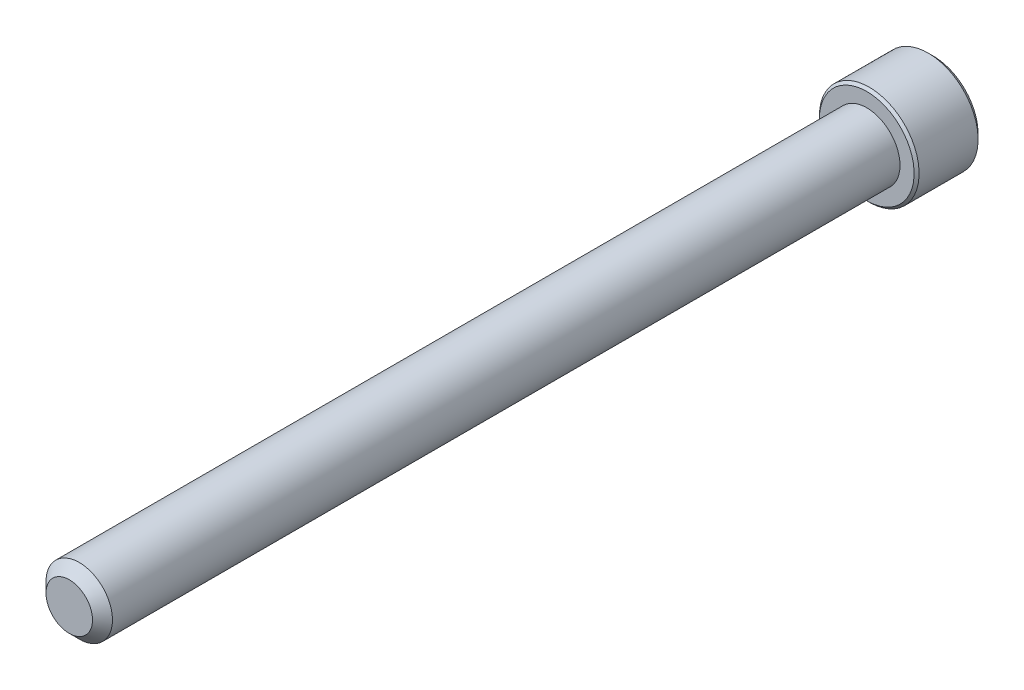
ISO-10303-21;
HEADER;
FILE_DESCRIPTION(('STEP AP214'),'2;1');
FILE_NAME('part.step','',(''),(''),'','','');
FILE_SCHEMA(('AUTOMOTIVE_DESIGN { 1 0 10303 214 1 1 1 1 }'));
ENDSEC;
DATA;
#1=APPLICATION_CONTEXT('core data for automotive mechanical design processes');
#2=APPLICATION_PROTOCOL_DEFINITION('international standard','automotive_design',2000,#1);
#3=PRODUCT_CONTEXT('',#1,'mechanical');
#4=PRODUCT('Part','Part','',(#3));
#5=PRODUCT_RELATED_PRODUCT_CATEGORY('part','',(#4));
#6=PRODUCT_DEFINITION_FORMATION('','',#4);
#7=PRODUCT_DEFINITION_CONTEXT('part definition',#1,'design');
#8=PRODUCT_DEFINITION('design','',#6,#7);
#9=PRODUCT_DEFINITION_SHAPE('','',#8);
#10=(LENGTH_UNIT() NAMED_UNIT(*) SI_UNIT(.MILLI.,.METRE.));
#11=(NAMED_UNIT(*) PLANE_ANGLE_UNIT() SI_UNIT($,.RADIAN.));
#12=(NAMED_UNIT(*) SI_UNIT($,.STERADIAN.) SOLID_ANGLE_UNIT());
#13=UNCERTAINTY_MEASURE_WITH_UNIT(LENGTH_MEASURE(1.E-05),#10,'distance_accuracy_value','');
#14=(GEOMETRIC_REPRESENTATION_CONTEXT(3) GLOBAL_UNCERTAINTY_ASSIGNED_CONTEXT((#13)) GLOBAL_UNIT_ASSIGNED_CONTEXT((#10,
#11,#12)) REPRESENTATION_CONTEXT('',''));
#15=CARTESIAN_POINT('',(0.,0.,0.));
#16=DIRECTION('',(0.,0.,1.));
#17=DIRECTION('',(1.,0.,0.));
#18=AXIS2_PLACEMENT_3D('',#15,#16,#17);
#19=CARTESIAN_POINT('',(0.,0.,-76.2));
#20=DIRECTION('',(0.,0.,1.));
#21=DIRECTION('',(1.,0.,0.));
#22=AXIS2_PLACEMENT_3D('',#19,#20,#21);
#23=CYLINDRICAL_SURFACE('',#22,3.175);
#24=CARTESIAN_POINT('',(0.,0.,-0.952499999999995));
#25=DIRECTION('',(0.,0.,1.));
#26=DIRECTION('',(1.,0.,0.));
#27=AXIS2_PLACEMENT_3D('',#24,#25,#26);
#28=CIRCLE('',#27,3.175);
#29=CARTESIAN_POINT('',(3.175,0.,-0.952499999999995));
#30=VERTEX_POINT('',#29);
#31=EDGE_CURVE('E109',#30,#30,#28,.F.);
#32=CARTESIAN_POINT('',(0.,0.,-76.2));
#33=DIRECTION('',(0.,0.,-1.));
#34=DIRECTION('',(-1.,0.,0.));
#35=AXIS2_PLACEMENT_3D('',#32,#33,#34);
#36=CIRCLE('',#35,3.175);
#37=CARTESIAN_POINT('',(3.175,0.,-76.2));
#38=VERTEX_POINT('',#37);
#39=EDGE_CURVE('E212',#38,#38,#36,.F.);
#40=CARTESIAN_POINT('',(3.175,0.,-0.952499999999995));
#41=CARTESIAN_POINT('',(3.175,0.,-1.736328125));
#42=CARTESIAN_POINT('',(3.175,0.,-2.52015625));
#43=CARTESIAN_POINT('',(3.175,0.,-4.0878125));
#44=CARTESIAN_POINT('',(3.175,0.,-4.87164062499999));
#45=CARTESIAN_POINT('',(3.175,0.,-6.43929687499999));
#46=CARTESIAN_POINT('',(3.175,0.,-7.22312499999999));
#47=CARTESIAN_POINT('',(3.175,0.,-8.79078124999999));
#48=CARTESIAN_POINT('',(3.175,0.,-9.574609375));
#49=CARTESIAN_POINT('',(3.175,0.,-11.142265625));
#50=CARTESIAN_POINT('',(3.175,0.,-11.92609375));
#51=CARTESIAN_POINT('',(3.175,0.,-13.49375));
#52=CARTESIAN_POINT('',(3.175,0.,-14.277578125));
#53=CARTESIAN_POINT('',(3.175,0.,-15.845234375));
#54=CARTESIAN_POINT('',(3.175,0.,-16.6290625));
#55=CARTESIAN_POINT('',(3.175,0.,-18.19671875));
#56=CARTESIAN_POINT('',(3.175,0.,-18.980546875));
#57=CARTESIAN_POINT('',(3.175,0.,-20.548203125));
#58=CARTESIAN_POINT('',(3.175,0.,-21.33203125));
#59=CARTESIAN_POINT('',(3.175,0.,-22.8996875));
#60=CARTESIAN_POINT('',(3.175,0.,-23.683515625));
#61=CARTESIAN_POINT('',(3.175,0.,-25.251171875));
#62=CARTESIAN_POINT('',(3.175,0.,-26.035));
#63=CARTESIAN_POINT('',(3.175,0.,-27.60265625));
#64=CARTESIAN_POINT('',(3.175,0.,-28.386484375));
#65=CARTESIAN_POINT('',(3.175,0.,-29.954140625));
#66=CARTESIAN_POINT('',(3.175,0.,-30.73796875));
#67=CARTESIAN_POINT('',(3.175,0.,-32.305625));
#68=CARTESIAN_POINT('',(3.175,0.,-33.089453125));
#69=CARTESIAN_POINT('',(3.175,0.,-34.657109375));
#70=CARTESIAN_POINT('',(3.175,0.,-35.4409375));
#71=CARTESIAN_POINT('',(3.175,0.,-37.00859375));
#72=CARTESIAN_POINT('',(3.175,0.,-37.792421875));
#73=CARTESIAN_POINT('',(3.175,0.,-39.360078125));
#74=CARTESIAN_POINT('',(3.175,0.,-40.14390625));
#75=CARTESIAN_POINT('',(3.175,0.,-41.7115625));
#76=CARTESIAN_POINT('',(3.175,0.,-42.495390625));
#77=CARTESIAN_POINT('',(3.175,0.,-44.063046875));
#78=CARTESIAN_POINT('',(3.175,0.,-44.846875));
#79=CARTESIAN_POINT('',(3.175,0.,-46.41453125));
#80=CARTESIAN_POINT('',(3.175,0.,-47.198359375));
#81=CARTESIAN_POINT('',(3.175,0.,-48.766015625));
#82=CARTESIAN_POINT('',(3.175,0.,-49.54984375));
#83=CARTESIAN_POINT('',(3.175,0.,-51.1175));
#84=CARTESIAN_POINT('',(3.175,0.,-51.901328125));
#85=CARTESIAN_POINT('',(3.175,0.,-53.468984375));
#86=CARTESIAN_POINT('',(3.175,0.,-54.2528125));
#87=CARTESIAN_POINT('',(3.175,0.,-55.82046875));
#88=CARTESIAN_POINT('',(3.175,0.,-56.604296875));
#89=CARTESIAN_POINT('',(3.175,0.,-58.171953125));
#90=CARTESIAN_POINT('',(3.175,0.,-58.95578125));
#91=CARTESIAN_POINT('',(3.175,0.,-60.5234375));
#92=CARTESIAN_POINT('',(3.175,0.,-61.307265625));
#93=CARTESIAN_POINT('',(3.175,0.,-62.874921875));
#94=CARTESIAN_POINT('',(3.175,0.,-63.65875));
#95=CARTESIAN_POINT('',(3.175,0.,-65.22640625));
#96=CARTESIAN_POINT('',(3.175,0.,-66.010234375));
#97=CARTESIAN_POINT('',(3.175,0.,-67.577890625));
#98=CARTESIAN_POINT('',(3.175,0.,-68.36171875));
#99=CARTESIAN_POINT('',(3.175,0.,-69.929375));
#100=CARTESIAN_POINT('',(3.175,0.,-70.713203125));
#101=CARTESIAN_POINT('',(3.175,0.,-72.280859375));
#102=CARTESIAN_POINT('',(3.175,0.,-73.0646875));
#103=CARTESIAN_POINT('',(3.175,0.,-74.63234375));
#104=CARTESIAN_POINT('',(3.175,0.,-75.416171875));
#105=CARTESIAN_POINT('',(3.175,0.,-76.2));
#106=B_SPLINE_CURVE_WITH_KNOTS('',3,(#40,#41,#42,#43,#44,#45,#46,#47,#48,#49,#50,#51,#52,#53,
#54,#55,#56,#57,#58,#59,#60,#61,#62,#63,#64,#65,#66,#67,#68,#69,#70,#71,#72,#73,#74,#75,#76,#77,
#78,#79,#80,#81,#82,#83,#84,#85,#86,#87,#88,#89,#90,#91,#92,#93,#94,#95,#96,#97,#98,#99,#100,
#101,#102,#103,#104,#105),.UNSPECIFIED.,.F.,.F.,(4,2,2,2,2,2,2,2,2,2,2,2,2,2,2,2,2,2,2,2,2,2,2,
2,2,2,2,2,2,2,2,2,4),(0.,2.351484375,4.70296874999999,7.054453125,9.4059375,11.757421875,
14.10890625,16.460390625,18.811875,21.163359375,23.51484375,25.866328125,28.2178125,
30.569296875,32.92078125,35.272265625,37.62375,39.975234375,42.32671875,44.678203125,47.0296875,
49.381171875,51.73265625,54.084140625,56.435625,58.787109375,61.13859375,63.490078125,
65.8415625,68.193046875,70.54453125,72.896015625,75.2475),.UNSPECIFIED.);
#107=EDGE_CURVE('BSEAM35',#30,#38,#106,.T.);
#108=ORIENTED_EDGE('',*,*,#31,.T.);
#109=ORIENTED_EDGE('',*,*,#39,.T.);
#110=ORIENTED_EDGE('',*,*,#107,.T.);
#111=ORIENTED_EDGE('',*,*,#107,.F.);
#112=EDGE_LOOP('',(#108,#110,#109,#111));
#113=FACE_BOUND('',#112,.T.);
#114=ADVANCED_FACE('F35',(#113),#23,.T.);
#115=CARTESIAN_POINT('',(0.,0.,0.));
#116=DIRECTION('',(0.,0.,1.));
#117=DIRECTION('',(1.,0.,0.));
#118=AXIS2_PLACEMENT_3D('',#115,#116,#117);
#119=PLANE('',#118);
#120=CARTESIAN_POINT('',(0.,0.,0.));
#121=DIRECTION('',(0.,0.,1.));
#122=DIRECTION('',(1.,0.,0.));
#123=AXIS2_PLACEMENT_3D('',#120,#121,#122);
#124=CIRCLE('',#123,2.2225);
#125=CARTESIAN_POINT('',(2.2225,0.,0.));
#126=VERTEX_POINT('',#125);
#127=EDGE_CURVE('E211',#126,#126,#124,.T.);
#128=ORIENTED_EDGE('',*,*,#127,.T.);
#129=EDGE_LOOP('',(#128));
#130=FACE_BOUND('',#129,.T.);
#131=ADVANCED_FACE('F189',(#130),#119,.T.);
#132=CARTESIAN_POINT('',(0.,0.,0.));
#133=DIRECTION('',(0.,0.,-1.));
#134=DIRECTION('',(-1.,0.,0.));
#135=AXIS2_PLACEMENT_3D('',#132,#133,#134);
#136=CONICAL_SURFACE('',#135,2.2225,0.785398163397457);
#137=ORIENTED_EDGE('',*,*,#31,.F.);
#138=EDGE_LOOP('',(#137));
#139=FACE_BOUND('',#138,.T.);
#140=ORIENTED_EDGE('',*,*,#127,.F.);
#141=EDGE_LOOP('',(#140));
#142=FACE_BOUND('',#141,.T.);
#143=ADVANCED_FACE('F195',(#139,#142),#136,.T.);
#144=CARTESIAN_POINT('',(0.,0.,-82.55));
#145=DIRECTION('',(0.,0.,1.));
#146=DIRECTION('',(1.,0.,0.));
#147=AXIS2_PLACEMENT_3D('',#144,#145,#146);
#148=CYLINDRICAL_SURFACE('',#147,4.7625);
#149=CARTESIAN_POINT('',(0.,0.,-76.438125));
#150=DIRECTION('',(0.,0.,-1.));
#151=DIRECTION('',(-1.,0.,0.));
#152=AXIS2_PLACEMENT_3D('',#149,#150,#151);
#153=CIRCLE('',#152,4.7625);
#154=CARTESIAN_POINT('',(-4.76249999999999,0.,-76.438125));
#155=VERTEX_POINT('',#154);
#156=EDGE_CURVE('E43',#155,#155,#153,.T.);
#157=ORIENTED_EDGE('',*,*,#156,.T.);
#158=EDGE_LOOP('',(#157));
#159=FACE_BOUND('',#158,.T.);
#160=CARTESIAN_POINT('',(0.,0.,-82.07375));
#161=DIRECTION('',(0.,0.,-1.));
#162=DIRECTION('',(-1.,0.,0.));
#163=AXIS2_PLACEMENT_3D('',#160,#161,#162);
#164=CIRCLE('',#163,4.7625);
#165=CARTESIAN_POINT('',(-4.7625,0.,-82.07375));
#166=VERTEX_POINT('',#165);
#167=EDGE_CURVE('E172',#166,#166,#164,.F.);
#168=ORIENTED_EDGE('',*,*,#167,.T.);
#169=EDGE_LOOP('',(#168));
#170=FACE_BOUND('',#169,.T.);
#171=ADVANCED_FACE('F177',(#159,#170),#148,.T.);
#172=CARTESIAN_POINT('',(0.,0.,-82.55));
#173=DIRECTION('',(0.,0.,-1.));
#174=DIRECTION('',(-1.,0.,0.));
#175=AXIS2_PLACEMENT_3D('',#172,#173,#174);
#176=PLANE('',#175);
#177=CARTESIAN_POINT('',(0.,0.,-82.55));
#178=DIRECTION('',(0.,0.,-1.));
#179=DIRECTION('',(-1.,0.,0.));
#180=AXIS2_PLACEMENT_3D('',#177,#178,#179);
#181=CIRCLE('',#180,4.28625000000001);
#182=CARTESIAN_POINT('',(-4.28625000000001,0.,-82.55));
#183=VERTEX_POINT('',#182);
#184=EDGE_CURVE('E108',#183,#183,#181,.T.);
#185=ORIENTED_EDGE('',*,*,#184,.T.);
#186=EDGE_LOOP('',(#185));
#187=FACE_BOUND('',#186,.T.);
#188=CARTESIAN_POINT('',(0.,0.,-82.55));
#189=DIRECTION('',(0.,0.,-1.));
#190=DIRECTION('',(-1.,0.,0.));
#191=AXIS2_PLACEMENT_3D('',#188,#189,#190);
#192=CIRCLE('',#191,2.74963065701559);
#193=CARTESIAN_POINT('',(-2.38125,1.3748153285078,-82.55));
#194=VERTEX_POINT('',#193);
#195=CARTESIAN_POINT('',(0.,2.74963065701559,-82.55));
#196=VERTEX_POINT('',#195);
#197=EDGE_CURVE('E89',#194,#196,#192,.T.);
#198=ORIENTED_EDGE('',*,*,#197,.F.);
#199=CARTESIAN_POINT('',(-2.38125,-1.3748153285078,-82.55));
#200=VERTEX_POINT('',#199);
#201=EDGE_CURVE('E49',#200,#194,#192,.T.);
#202=ORIENTED_EDGE('',*,*,#201,.F.);
#203=CARTESIAN_POINT('',(0.,-2.74963065701559,-82.55));
#204=VERTEX_POINT('',#203);
#205=EDGE_CURVE('E271',#204,#200,#192,.T.);
#206=ORIENTED_EDGE('',*,*,#205,.F.);
#207=CARTESIAN_POINT('',(2.38125,-1.37481532850779,-82.55));
#208=VERTEX_POINT('',#207);
#209=EDGE_CURVE('E56',#208,#204,#192,.T.);
#210=ORIENTED_EDGE('',*,*,#209,.F.);
#211=CARTESIAN_POINT('',(2.38125,1.3748153285078,-82.55));
#212=VERTEX_POINT('',#211);
#213=EDGE_CURVE('E130',#212,#208,#192,.T.);
#214=ORIENTED_EDGE('',*,*,#213,.F.);
#215=EDGE_CURVE('E98',#196,#212,#192,.T.);
#216=ORIENTED_EDGE('',*,*,#215,.F.);
#217=EDGE_LOOP('',(#198,#202,#206,#210,#214,#216));
#218=FACE_BOUND('',#217,.T.);
#219=ADVANCED_FACE('F129',(#187,#218),#176,.T.);
#220=CARTESIAN_POINT('',(0.,0.,-76.2));
#221=DIRECTION('',(0.,0.,-1.));
#222=DIRECTION('',(-1.,0.,0.));
#223=AXIS2_PLACEMENT_3D('',#220,#221,#222);
#224=PLANE('',#223);
#225=CARTESIAN_POINT('',(0.,0.,-76.2));
#226=DIRECTION('',(0.,0.,-1.));
#227=DIRECTION('',(-1.,0.,0.));
#228=AXIS2_PLACEMENT_3D('',#225,#226,#227);
#229=CIRCLE('',#228,4.524375);
#230=CARTESIAN_POINT('',(-4.52437499999999,0.,-76.2));
#231=VERTEX_POINT('',#230);
#232=EDGE_CURVE('E11',#231,#231,#229,.F.);
#233=ORIENTED_EDGE('',*,*,#232,.T.);
#234=EDGE_LOOP('',(#233));
#235=FACE_BOUND('',#234,.T.);
#236=ORIENTED_EDGE('',*,*,#39,.F.);
#237=EDGE_LOOP('',(#236));
#238=FACE_BOUND('',#237,.T.);
#239=ADVANCED_FACE('F283',(#235,#238),#224,.F.);
#240=CARTESIAN_POINT('',(0.,0.,-82.55));
#241=DIRECTION('',(0.,0.,-1.));
#242=DIRECTION('',(-1.,0.,0.));
#243=AXIS2_PLACEMENT_3D('',#240,#241,#242);
#244=CONICAL_SURFACE('',#243,2.74963065701559,0.78539816339745);
#245=ORIENTED_EDGE('',*,*,#215,.T.);
#246=CARTESIAN_POINT('',(-0.000200000000002362,2.74974612706943,-82.5501154773272));
#247=CARTESIAN_POINT('',(0.0816567823790494,2.70248609172789,-82.5028948967095));
#248=CARTESIAN_POINT('',(0.16488233377176,2.65443579722785,-82.4584475752929));
#249=CARTESIAN_POINT('',(0.33458848083804,2.556455907536,-82.3770654569856));
#250=CARTESIAN_POINT('',(0.421085217353102,2.50651699342501,-82.3401759430951));
#251=CARTESIAN_POINT('',(0.595501774009042,2.40581754748857,-82.2769834131659));
#252=CARTESIAN_POINT('',(0.683377171180675,2.35508266327638,-82.2505215587295));
#253=CARTESIAN_POINT('',(0.861062594070876,2.25249593653965,-82.209751515616));
#254=CARTESIAN_POINT('',(0.950867191185869,2.20064722822085,-82.1954128915305));
#255=CARTESIAN_POINT('',(1.10563960313034,2.11128933452158,-82.1824757847701));
#256=CARTESIAN_POINT('',(1.17040744896962,2.07389560129144,-82.1805606046532));
#257=CARTESIAN_POINT('',(1.29983727933557,1.99916925388849,-82.1837866227677));
#258=CARTESIAN_POINT('',(1.36449921879335,1.96183666573622,-82.1889302948571));
#259=CARTESIAN_POINT('',(1.49321254857739,1.88752399013711,-82.2059813108716));
#260=CARTESIAN_POINT('',(1.55726317423485,1.85054434417201,-82.2178962213493));
#261=CARTESIAN_POINT('',(1.68425683890527,1.77722451768917,-82.247835672352));
#262=CARTESIAN_POINT('',(1.74719996243582,1.74088428837517,-82.2658597445184));
#263=CARTESIAN_POINT('',(1.90842615073218,1.64780030516185,-82.3193688075524));
#264=CARTESIAN_POINT('',(2.00570949128784,1.59163374230437,-82.3588874208722));
#265=CARTESIAN_POINT('',(2.14875606262557,1.50904576583588,-82.4256003435508));
#266=CARTESIAN_POINT('',(2.19589628894397,1.48182934348129,-82.4490402091113));
#267=CARTESIAN_POINT('',(2.28930352636664,1.42790064981105,-82.4980566766595));
#268=CARTESIAN_POINT('',(2.33557105249682,1.40118808114505,-82.5236319667669));
#269=CARTESIAN_POINT('',(2.38145,1.37469985845396,-82.5501154773272));
#270=B_SPLINE_CURVE_WITH_KNOTS('',3,(#246,#247,#248,#249,#250,#251,#252,#253,#254,#255,#256,
#257,#258,#259,#260,#261,#262,#263,#264,#265,#266,#267,#268,#269),.UNSPECIFIED.,.F.,.F.,(4,2,2,
2,2,2,2,2,2,2,2,4),(0.,0.317196610611951,0.636241461041222,0.950218950629228,1.26340583824126,
1.48752413747844,1.71172100167747,1.93616888974082,2.16059957440836,2.51709639744764,
2.694861473691,2.87251813383155),.UNSPECIFIED.);
#271=EDGE_CURVE('E103',#196,#212,#270,.T.);
#272=ORIENTED_EDGE('',*,*,#271,.F.);
#273=EDGE_LOOP('',(#245,#272));
#274=FACE_BOUND('',#273,.T.);
#275=ADVANCED_FACE('F104',(#274),#244,.F.);
#276=ORIENTED_EDGE('',*,*,#213,.T.);
#277=CARTESIAN_POINT('',(2.38125,-2.74194290589387,-83.4319808945799));
#278=CARTESIAN_POINT('',(2.38125,-2.6751796105604,-83.3815846679781));
#279=CARTESIAN_POINT('',(2.38125,-2.60804251112753,-83.3316755875907));
#280=CARTESIAN_POINT('',(2.38125,-2.47287325055307,-83.2330498309857));
#281=CARTESIAN_POINT('',(2.38125,-2.40484086895313,-83.1843334572448));
#282=CARTESIAN_POINT('',(2.38125,-2.26723593505442,-83.0879648544535));
#283=CARTESIAN_POINT('',(2.38125,-2.1976555334605,-83.0403237954326));
#284=CARTESIAN_POINT('',(2.38125,-2.05731367842204,-82.9468199233866));
#285=CARTESIAN_POINT('',(2.38125,-1.98655230892574,-82.9009569847287));
#286=CARTESIAN_POINT('',(2.38125,-1.83957751909227,-82.8088459007133));
#287=CARTESIAN_POINT('',(2.38125,-1.76328361992077,-82.7627255173929));
#288=CARTESIAN_POINT('',(2.38125,-1.60891357704461,-82.6735183038905));
#289=CARTESIAN_POINT('',(2.38125,-1.53083712149138,-82.6304320099754));
#290=CARTESIAN_POINT('',(2.38125,-1.37291620334515,-82.5482265014712));
#291=CARTESIAN_POINT('',(2.38125,-1.29307799938229,-82.5090953578519));
#292=CARTESIAN_POINT('',(2.38125,-1.13121425093133,-82.4356679503152));
#293=CARTESIAN_POINT('',(2.38125,-1.04918943681796,-82.4013700954538));
#294=CARTESIAN_POINT('',(2.38125,-0.889535256759279,-82.3413546314156));
#295=CARTESIAN_POINT('',(2.38125,-0.812083865770267,-82.315168478432));
#296=CARTESIAN_POINT('',(2.38125,-0.655316366527669,-82.2690097514868));
#297=CARTESIAN_POINT('',(2.38125,-0.576000130216834,-82.2490376055838));
#298=CARTESIAN_POINT('',(2.38125,-0.417295761573375,-82.2166821452488));
#299=CARTESIAN_POINT('',(2.38125,-0.337934576883846,-82.2041688083548));
#300=CARTESIAN_POINT('',(2.38125,-0.178363852969581,-82.1869738601659));
#301=CARTESIAN_POINT('',(2.38125,-0.0981544619617629,-82.1822909026126));
#302=CARTESIAN_POINT('',(2.38125,0.0594188034321334,-82.1811044408392));
#303=CARTESIAN_POINT('',(2.38125,0.136780588525996,-82.1843110105046));
#304=CARTESIAN_POINT('',(2.38125,0.290840960607339,-82.1980870567428));
#305=CARTESIAN_POINT('',(2.38125,0.367539482435409,-82.2086572485871));
#306=CARTESIAN_POINT('',(2.38125,0.521017492835387,-82.2367628298525));
#307=CARTESIAN_POINT('',(2.38125,0.597774958394048,-82.2544167489315));
#308=CARTESIAN_POINT('',(2.38125,0.74960981425701,-82.2957513962434));
#309=CARTESIAN_POINT('',(2.38125,0.824687344568027,-82.3194316201904));
#310=CARTESIAN_POINT('',(2.38125,1.06107814410025,-82.402894862956));
#311=CARTESIAN_POINT('',(2.38125,1.2190478622181,-82.4721839270396));
#312=CARTESIAN_POINT('',(2.38125,1.45021000267341,-82.5876640838597));
#313=CARTESIAN_POINT('',(2.38125,1.52644290442584,-82.6281730572583));
#314=CARTESIAN_POINT('',(2.38125,1.67717618538172,-82.7123026892371));
#315=CARTESIAN_POINT('',(2.38125,1.7516768735884,-82.7559227870999));
#316=CARTESIAN_POINT('',(2.38125,1.89548152088328,-82.843412556489));
#317=CARTESIAN_POINT('',(2.38125,1.96485959608998,-82.8871617927418));
#318=CARTESIAN_POINT('',(2.38125,2.10242624411169,-82.9765011587306));
#319=CARTESIAN_POINT('',(2.38125,2.17061472626633,-83.0220914279041));
#320=CARTESIAN_POINT('',(2.38125,2.30540317317354,-83.1144060050932));
#321=CARTESIAN_POINT('',(2.38125,2.37201154222166,-83.1611180928962));
#322=CARTESIAN_POINT('',(2.38125,2.50431800054459,-83.2557775780183));
#323=CARTESIAN_POINT('',(2.38125,2.57001633510792,-83.3037246320963));
#324=CARTESIAN_POINT('',(2.38125,2.63533378855947,-83.3521767335425));
#325=B_SPLINE_CURVE_WITH_KNOTS('',3,(#277,#278,#279,#280,#281,#282,#283,#284,#285,#286,#287,
#288,#289,#290,#291,#292,#293,#294,#295,#296,#297,#298,#299,#300,#301,#302,#303,#304,#305,#306,
#307,#308,#309,#310,#311,#312,#313,#314,#315,#316,#317,#318,#319,#320,#321,#322,#323,#324),
.UNSPECIFIED.,.F.,.F.,(4,2,2,2,2,2,2,2,2,2,2,2,2,2,2,2,2,2,2,2,2,2,2,4),(0.,0.250951284009993,
0.501965564827874,0.754924775973584,1.00786608164542,1.27526207798891,1.54270521780082,
1.80931602029338,2.07583885812519,2.32089852590463,2.56597507114536,2.80664400307699,
3.04727155311266,3.27918940971451,3.51112979698762,3.74712477407483,3.98310000940112,
4.49898139184705,4.75794323931355,5.01685853149448,5.26288960015361,5.50893933794673,
5.75299038397142,5.9969743162797),.UNSPECIFIED.);
#326=EDGE_CURVE('E97',#212,#208,#325,.F.);
#327=ORIENTED_EDGE('',*,*,#326,.F.);
#328=EDGE_LOOP('',(#276,#327));
#329=FACE_BOUND('',#328,.T.);
#330=ADVANCED_FACE('F277',(#329),#244,.F.);
#331=ORIENTED_EDGE('',*,*,#209,.T.);
#332=CARTESIAN_POINT('',(2.38145,-1.37469985845396,-82.5501154773272));
#333=CARTESIAN_POINT('',(2.29959321762095,-1.4219598937955,-82.5028948967095));
#334=CARTESIAN_POINT('',(2.21636766622824,-1.47001018829554,-82.4584475752929));
#335=CARTESIAN_POINT('',(2.04666151916196,-1.56799007798739,-82.3770654569856));
#336=CARTESIAN_POINT('',(1.9601647826469,-1.61792899209838,-82.3401759430951));
#337=CARTESIAN_POINT('',(1.78574822599096,-1.71862843803482,-82.2769834131659));
#338=CARTESIAN_POINT('',(1.69787282881932,-1.769363322247,-82.2505215587295));
#339=CARTESIAN_POINT('',(1.52018740592912,-1.87195004898373,-82.209751515616));
#340=CARTESIAN_POINT('',(1.43038280881413,-1.92379875730254,-82.1954128915305));
#341=CARTESIAN_POINT('',(1.27561039686966,-2.01315665100181,-82.1824757847701));
#342=CARTESIAN_POINT('',(1.21084255103038,-2.05055038423195,-82.1805606046532));
#343=CARTESIAN_POINT('',(1.08141272066443,-2.1252767316349,-82.1837866227677));
#344=CARTESIAN_POINT('',(1.01675078120665,-2.16260931978717,-82.1889302948571));
#345=CARTESIAN_POINT('',(0.888037451422605,-2.23692199538628,-82.2059813108716));
#346=CARTESIAN_POINT('',(0.823986825765148,-2.27390164135138,-82.2178962213493));
#347=CARTESIAN_POINT('',(0.696993161094728,-2.34722146783422,-82.247835672352));
#348=CARTESIAN_POINT('',(0.634050037564178,-2.38356169714822,-82.2658597445184));
#349=CARTESIAN_POINT('',(0.472823849267818,-2.47664568036154,-82.3193688075524));
#350=CARTESIAN_POINT('',(0.375540508712157,-2.53281224321902,-82.3588874208722));
#351=CARTESIAN_POINT('',(0.232493937374426,-2.61540021968751,-82.4256003435508));
#352=CARTESIAN_POINT('',(0.185353711056032,-2.6426166420421,-82.4490402091113));
#353=CARTESIAN_POINT('',(0.0919464736333587,-2.69654533571234,-82.4980566766595));
#354=CARTESIAN_POINT('',(0.0456789475031753,-2.72325790437834,-82.5236319667669));
#355=CARTESIAN_POINT('',(-0.000200000000005381,-2.74974612706943,-82.5501154773272));
#356=B_SPLINE_CURVE_WITH_KNOTS('',3,(#332,#333,#334,#335,#336,#337,#338,#339,#340,#341,#342,
#343,#344,#345,#346,#347,#348,#349,#350,#351,#352,#353,#354,#355),.UNSPECIFIED.,.F.,.F.,(4,2,2,
2,2,2,2,2,2,2,2,4),(0.,0.317196610611952,0.636241461041222,0.950218950629225,1.26340583824126,
1.48752413747844,1.71172100167747,1.93616888974082,2.16059957440836,2.51709639744764,
2.694861473691,2.87251813383155),.UNSPECIFIED.);
#357=EDGE_CURVE('E140',#208,#204,#356,.T.);
#358=ORIENTED_EDGE('',*,*,#357,.F.);
#359=EDGE_LOOP('',(#331,#358));
#360=FACE_BOUND('',#359,.T.);
#361=ADVANCED_FACE('F274',(#360),#244,.F.);
#362=ORIENTED_EDGE('',*,*,#205,.T.);
#363=CARTESIAN_POINT('',(0.000200000000001792,-2.74974612706943,-82.5501154773272));
#364=CARTESIAN_POINT('',(-0.0816567823790504,-2.70248609172789,-82.5028948967095));
#365=CARTESIAN_POINT('',(-0.164882333771761,-2.65443579722785,-82.4584475752929));
#366=CARTESIAN_POINT('',(-0.334588480838041,-2.556455907536,-82.3770654569856));
#367=CARTESIAN_POINT('',(-0.421085217353103,-2.50651699342501,-82.3401759430951));
#368=CARTESIAN_POINT('',(-0.595501774009043,-2.40581754748857,-82.2769834131659));
#369=CARTESIAN_POINT('',(-0.683377171180675,-2.35508266327638,-82.2505215587295));
#370=CARTESIAN_POINT('',(-0.861062594070875,-2.25249593653965,-82.209751515616));
#371=CARTESIAN_POINT('',(-0.95086719118587,-2.20064722822085,-82.1954128915305));
#372=CARTESIAN_POINT('',(-1.10563960313034,-2.11128933452158,-82.1824757847701));
#373=CARTESIAN_POINT('',(-1.17040744896962,-2.07389560129144,-82.1805606046532));
#374=CARTESIAN_POINT('',(-1.29983727933557,-1.99916925388849,-82.1837866227677));
#375=CARTESIAN_POINT('',(-1.36449921879335,-1.96183666573622,-82.1889302948571));
#376=CARTESIAN_POINT('',(-1.4932125485774,-1.88752399013711,-82.2059813108716));
#377=CARTESIAN_POINT('',(-1.55726317423485,-1.85054434417201,-82.2178962213493));
#378=CARTESIAN_POINT('',(-1.68425683890527,-1.77722451768917,-82.247835672352));
#379=CARTESIAN_POINT('',(-1.74719996243582,-1.74088428837517,-82.2658597445184));
#380=CARTESIAN_POINT('',(-1.90842615073218,-1.64780030516185,-82.3193688075524));
#381=CARTESIAN_POINT('',(-2.00570949128784,-1.59163374230437,-82.3588874208722));
#382=CARTESIAN_POINT('',(-2.14875606262558,-1.50904576583588,-82.4256003435508));
#383=CARTESIAN_POINT('',(-2.19589628894397,-1.48182934348129,-82.4490402091113));
#384=CARTESIAN_POINT('',(-2.28930352636665,-1.42790064981105,-82.4980566766595));
#385=CARTESIAN_POINT('',(-2.33557105249683,-1.40118808114505,-82.5236319667669));
#386=CARTESIAN_POINT('',(-2.38145,-1.37469985845396,-82.5501154773272));
#387=B_SPLINE_CURVE_WITH_KNOTS('',3,(#363,#364,#365,#366,#367,#368,#369,#370,#371,#372,#373,
#374,#375,#376,#377,#378,#379,#380,#381,#382,#383,#384,#385,#386),.UNSPECIFIED.,.F.,.F.,(4,2,2,
2,2,2,2,2,2,2,2,4),(0.,0.317196610611952,0.636241461041222,0.950218950629226,1.26340583824126,
1.48752413747844,1.71172100167747,1.93616888974082,2.16059957440837,2.51709639744763,
2.69486147369101,2.87251813383155),.UNSPECIFIED.);
#388=EDGE_CURVE('E248',#204,#200,#387,.T.);
#389=ORIENTED_EDGE('',*,*,#388,.F.);
#390=EDGE_LOOP('',(#362,#389));
#391=FACE_BOUND('',#390,.T.);
#392=ADVANCED_FACE('F273',(#391),#244,.F.);
#393=ORIENTED_EDGE('',*,*,#201,.T.);
#394=CARTESIAN_POINT('',(-2.38125,-2.74194290589388,-83.4319808945799));
#395=CARTESIAN_POINT('',(-2.38125,-2.6751796105604,-83.3815846679781));
#396=CARTESIAN_POINT('',(-2.38125,-2.60804251112753,-83.3316755875907));
#397=CARTESIAN_POINT('',(-2.38125,-2.47287325055308,-83.2330498309857));
#398=CARTESIAN_POINT('',(-2.38125,-2.40484086895314,-83.1843334572448));
#399=CARTESIAN_POINT('',(-2.38125,-2.26723593505442,-83.0879648544534));
#400=CARTESIAN_POINT('',(-2.38125,-2.19765553346049,-83.0403237954326));
#401=CARTESIAN_POINT('',(-2.38125,-2.05731367842203,-82.9468199233866));
#402=CARTESIAN_POINT('',(-2.38125,-1.98655230892573,-82.9009569847287));
#403=CARTESIAN_POINT('',(-2.38125,-1.83957751909225,-82.8088459007133));
#404=CARTESIAN_POINT('',(-2.38125,-1.76328361992075,-82.7627255173929));
#405=CARTESIAN_POINT('',(-2.38125,-1.6089135770446,-82.6735183038905));
#406=CARTESIAN_POINT('',(-2.38125,-1.53083712149137,-82.6304320099754));
#407=CARTESIAN_POINT('',(-2.38125,-1.37291620334514,-82.5482265014712));
#408=CARTESIAN_POINT('',(-2.38125,-1.29307799938228,-82.5090953578519));
#409=CARTESIAN_POINT('',(-2.38125,-1.13121425093132,-82.4356679503151));
#410=CARTESIAN_POINT('',(-2.38125,-1.04918943681796,-82.4013700954537));
#411=CARTESIAN_POINT('',(-2.38125,-0.889535256759273,-82.3413546314156));
#412=CARTESIAN_POINT('',(-2.38125,-0.812083865770258,-82.315168478432));
#413=CARTESIAN_POINT('',(-2.38125,-0.65531636652766,-82.2690097514868));
#414=CARTESIAN_POINT('',(-2.38125,-0.576000130216828,-82.2490376055837));
#415=CARTESIAN_POINT('',(-2.38125,-0.417295761573373,-82.2166821452488));
#416=CARTESIAN_POINT('',(-2.38125,-0.337934576883845,-82.2041688083547));
#417=CARTESIAN_POINT('',(-2.38125,-0.178363852969581,-82.1869738601659));
#418=CARTESIAN_POINT('',(-2.38125,-0.0981544619617637,-82.1822909026126));
#419=CARTESIAN_POINT('',(-2.38125,0.0594188034321319,-82.1811044408392));
#420=CARTESIAN_POINT('',(-2.38125,0.136780588525994,-82.1843110105046));
#421=CARTESIAN_POINT('',(-2.38125,0.29084096060734,-82.1980870567428));
#422=CARTESIAN_POINT('',(-2.38125,0.367539482435411,-82.2086572485871));
#423=CARTESIAN_POINT('',(-2.38125,0.521017492835389,-82.2367628298525));
#424=CARTESIAN_POINT('',(-2.38125,0.597774958394048,-82.2544167489315));
#425=CARTESIAN_POINT('',(-2.38125,0.749609814257009,-82.2957513962434));
#426=CARTESIAN_POINT('',(-2.38125,0.824687344568027,-82.3194316201904));
#427=CARTESIAN_POINT('',(-2.38125,1.06107814410026,-82.402894862956));
#428=CARTESIAN_POINT('',(-2.38125,1.2190478622181,-82.4721839270396));
#429=CARTESIAN_POINT('',(-2.38125,1.45021000267341,-82.5876640838597));
#430=CARTESIAN_POINT('',(-2.38125,1.52644290442585,-82.6281730572583));
#431=CARTESIAN_POINT('',(-2.38125,1.67717618538172,-82.7123026892371));
#432=CARTESIAN_POINT('',(-2.38125,1.75167687358839,-82.7559227870999));
#433=CARTESIAN_POINT('',(-2.38125,1.89548152088327,-82.843412556489));
#434=CARTESIAN_POINT('',(-2.38125,1.96485959608998,-82.8871617927418));
#435=CARTESIAN_POINT('',(-2.38125,2.10242624411169,-82.9765011587306));
#436=CARTESIAN_POINT('',(-2.38125,2.17061472626633,-83.0220914279041));
#437=CARTESIAN_POINT('',(-2.38125,2.30540317317354,-83.1144060050932));
#438=CARTESIAN_POINT('',(-2.38125,2.37201154222166,-83.1611180928962));
#439=CARTESIAN_POINT('',(-2.38125,2.50431800054459,-83.2557775780183));
#440=CARTESIAN_POINT('',(-2.38125,2.57001633510792,-83.3037246320963));
#441=CARTESIAN_POINT('',(-2.38125,2.63533378855947,-83.3521767335425));
#442=B_SPLINE_CURVE_WITH_KNOTS('',3,(#394,#395,#396,#397,#398,#399,#400,#401,#402,#403,#404,
#405,#406,#407,#408,#409,#410,#411,#412,#413,#414,#415,#416,#417,#418,#419,#420,#421,#422,#423,
#424,#425,#426,#427,#428,#429,#430,#431,#432,#433,#434,#435,#436,#437,#438,#439,#440,#441),
.UNSPECIFIED.,.F.,.F.,(4,2,2,2,2,2,2,2,2,2,2,2,2,2,2,2,2,2,2,2,2,2,2,4),(0.,0.250951284009989,
0.501965564827892,0.754924775973611,1.00786608164544,1.27526207798894,1.54270521780084,
1.80931602029341,2.07583885812521,2.32089852590465,2.56597507114538,2.806644003077,
3.04727155311267,3.27918940971453,3.51112979698764,3.74712477407485,3.98310000940113,
4.49898139184707,4.75794323931356,5.01685853149449,5.26288960015362,5.50893933794674,
5.75299038397143,5.99697431627972),.UNSPECIFIED.);
#443=EDGE_CURVE('E119',#200,#194,#442,.T.);
#444=ORIENTED_EDGE('',*,*,#443,.F.);
#445=EDGE_LOOP('',(#393,#444));
#446=FACE_BOUND('',#445,.T.);
#447=ADVANCED_FACE('F290',(#446),#244,.F.);
#448=ORIENTED_EDGE('',*,*,#197,.T.);
#449=CARTESIAN_POINT('',(-2.38145,1.37469985845396,-82.5501154773272));
#450=CARTESIAN_POINT('',(-2.29959321762095,1.4219598937955,-82.5028948967095));
#451=CARTESIAN_POINT('',(-2.21636766622824,1.47001018829554,-82.4584475752929));
#452=CARTESIAN_POINT('',(-2.04666151916196,1.56799007798739,-82.3770654569856));
#453=CARTESIAN_POINT('',(-1.9601647826469,1.61792899209838,-82.3401759430951));
#454=CARTESIAN_POINT('',(-1.78574822599096,1.71862843803482,-82.2769834131659));
#455=CARTESIAN_POINT('',(-1.69787282881932,1.76936332224701,-82.2505215587295));
#456=CARTESIAN_POINT('',(-1.52018740592912,1.87195004898373,-82.209751515616));
#457=CARTESIAN_POINT('',(-1.43038280881413,1.92379875730254,-82.1954128915305));
#458=CARTESIAN_POINT('',(-1.27561039686966,2.01315665100181,-82.1824757847701));
#459=CARTESIAN_POINT('',(-1.21084255103038,2.05055038423195,-82.1805606046532));
#460=CARTESIAN_POINT('',(-1.08141272066443,2.1252767316349,-82.1837866227677));
#461=CARTESIAN_POINT('',(-1.01675078120664,2.16260931978717,-82.1889302948571));
#462=CARTESIAN_POINT('',(-0.888037451422603,2.23692199538628,-82.2059813108716));
#463=CARTESIAN_POINT('',(-0.823986825765146,2.27390164135138,-82.2178962213493));
#464=CARTESIAN_POINT('',(-0.696993161094726,2.34722146783422,-82.247835672352));
#465=CARTESIAN_POINT('',(-0.634050037564175,2.38356169714822,-82.2658597445184));
#466=CARTESIAN_POINT('',(-0.472823849267816,2.47664568036154,-82.3193688075524));
#467=CARTESIAN_POINT('',(-0.375540508712155,2.53281224321902,-82.3588874208722));
#468=CARTESIAN_POINT('',(-0.232493937374425,2.61540021968751,-82.4256003435508));
#469=CARTESIAN_POINT('',(-0.185353711056031,2.6426166420421,-82.4490402091113));
#470=CARTESIAN_POINT('',(-0.0919464736333582,2.69654533571234,-82.4980566766595));
#471=CARTESIAN_POINT('',(-0.0456789475031749,2.72325790437833,-82.5236319667669));
#472=CARTESIAN_POINT('',(0.000200000000005878,2.74974612706943,-82.5501154773272));
#473=B_SPLINE_CURVE_WITH_KNOTS('',3,(#449,#450,#451,#452,#453,#454,#455,#456,#457,#458,#459,
#460,#461,#462,#463,#464,#465,#466,#467,#468,#469,#470,#471,#472),.UNSPECIFIED.,.F.,.F.,(4,2,2,
2,2,2,2,2,2,2,2,4),(0.,0.317196610611951,0.636241461041222,0.950218950629228,1.26340583824126,
1.48752413747844,1.71172100167747,1.93616888974082,2.16059957440836,2.51709639744764,
2.694861473691,2.87251813383155),.UNSPECIFIED.);
#474=EDGE_CURVE('E93',#194,#196,#473,.T.);
#475=ORIENTED_EDGE('',*,*,#474,.F.);
#476=EDGE_LOOP('',(#448,#475));
#477=FACE_BOUND('',#476,.T.);
#478=ADVANCED_FACE('F91',(#477),#244,.F.);
#479=CARTESIAN_POINT('',(2.38125,4.12444598552339,-78.978125));
#480=DIRECTION('',(0.,0.,-1.));
#481=DIRECTION('',(-1.,0.,0.));
#482=AXIS2_PLACEMENT_3D('',#479,#480,#481);
#483=PLANE('',#482);
#484=DIRECTION('',(0.866025403784439,0.5,0.));
#485=VECTOR('',#484,1.);
#486=CARTESIAN_POINT('',(-2.38125,1.3748153285078,-78.978125));
#487=LINE('',#486,#485);
#488=CARTESIAN_POINT('',(-2.38125,1.3748153285078,-78.978125));
#489=VERTEX_POINT('',#488);
#490=CARTESIAN_POINT('',(0.,2.74963065701559,-78.978125));
#491=VERTEX_POINT('',#490);
#492=EDGE_CURVE('E118',#489,#491,#487,.T.);
#493=ORIENTED_EDGE('',*,*,#492,.T.);
#494=DIRECTION('',(0.866025403784439,-0.5,0.));
#495=VECTOR('',#494,1.);
#496=CARTESIAN_POINT('',(0.,2.74963065701559,-78.978125));
#497=LINE('',#496,#495);
#498=CARTESIAN_POINT('',(2.38125,1.3748153285078,-78.978125));
#499=VERTEX_POINT('',#498);
#500=EDGE_CURVE('E123',#491,#499,#497,.T.);
#501=ORIENTED_EDGE('',*,*,#500,.T.);
#502=DIRECTION('',(0.,-1.,0.));
#503=VECTOR('',#502,1.);
#504=CARTESIAN_POINT('',(2.38125,1.3748153285078,-78.978125));
#505=LINE('',#504,#503);
#506=CARTESIAN_POINT('',(2.38125,-1.3748153285078,-78.978125));
#507=VERTEX_POINT('',#506);
#508=EDGE_CURVE('E234',#499,#507,#505,.T.);
#509=ORIENTED_EDGE('',*,*,#508,.T.);
#510=DIRECTION('',(-0.866025403784439,-0.5,0.));
#511=VECTOR('',#510,1.);
#512=CARTESIAN_POINT('',(2.38125,-1.3748153285078,-78.978125));
#513=LINE('',#512,#511);
#514=CARTESIAN_POINT('',(0.,-2.74963065701559,-78.978125));
#515=VERTEX_POINT('',#514);
#516=EDGE_CURVE('E231',#507,#515,#513,.T.);
#517=ORIENTED_EDGE('',*,*,#516,.T.);
#518=DIRECTION('',(-0.866025403784439,0.5,0.));
#519=VECTOR('',#518,1.);
#520=CARTESIAN_POINT('',(0.,-2.74963065701559,-78.978125));
#521=LINE('',#520,#519);
#522=CARTESIAN_POINT('',(-2.38125,-1.3748153285078,-78.978125));
#523=VERTEX_POINT('',#522);
#524=EDGE_CURVE('E228',#515,#523,#521,.T.);
#525=ORIENTED_EDGE('',*,*,#524,.T.);
#526=DIRECTION('',(0.,1.,0.));
#527=VECTOR('',#526,1.);
#528=CARTESIAN_POINT('',(-2.38125,-1.3748153285078,-78.978125));
#529=LINE('',#528,#527);
#530=EDGE_CURVE('E126',#523,#489,#529,.T.);
#531=ORIENTED_EDGE('',*,*,#530,.T.);
#532=EDGE_LOOP('',(#493,#501,#509,#517,#525,#531));
#533=FACE_BOUND('',#532,.T.);
#534=ADVANCED_FACE('F160',(#533),#483,.T.);
#535=CARTESIAN_POINT('',(0.,2.74963065701559,-78.978125));
#536=DIRECTION('',(0.5,0.866025403784439,0.));
#537=DIRECTION('',(-0.866025403784439,0.5,0.));
#538=AXIS2_PLACEMENT_3D('',#535,#536,#537);
#539=PLANE('',#538);
#540=DIRECTION('',(0.,0.,-1.));
#541=VECTOR('',#540,1.);
#542=CARTESIAN_POINT('',(0.,2.74963065701559,-78.978125));
#543=LINE('',#542,#541);
#544=EDGE_CURVE('E115',#491,#196,#543,.T.);
#545=ORIENTED_EDGE('',*,*,#544,.T.);
#546=ORIENTED_EDGE('',*,*,#271,.T.);
#547=DIRECTION('',(0.,0.,-1.));
#548=VECTOR('',#547,1.);
#549=CARTESIAN_POINT('',(2.38125,1.3748153285078,-78.978125));
#550=LINE('',#549,#548);
#551=EDGE_CURVE('E125',#499,#212,#550,.T.);
#552=ORIENTED_EDGE('',*,*,#551,.F.);
#553=ORIENTED_EDGE('',*,*,#500,.F.);
#554=EDGE_LOOP('',(#545,#546,#552,#553));
#555=FACE_BOUND('',#554,.T.);
#556=ADVANCED_FACE('F121',(#555),#539,.F.);
#557=CARTESIAN_POINT('',(2.38125,1.3748153285078,-78.978125));
#558=DIRECTION('',(1.,0.,0.));
#559=DIRECTION('',(0.,0.,-1.));
#560=AXIS2_PLACEMENT_3D('',#557,#558,#559);
#561=PLANE('',#560);
#562=ORIENTED_EDGE('',*,*,#551,.T.);
#563=ORIENTED_EDGE('',*,*,#326,.T.);
#564=DIRECTION('',(0.,0.,-1.));
#565=VECTOR('',#564,1.);
#566=CARTESIAN_POINT('',(2.38125,-1.3748153285078,-78.978125));
#567=LINE('',#566,#565);
#568=EDGE_CURVE('E217',#507,#208,#567,.T.);
#569=ORIENTED_EDGE('',*,*,#568,.F.);
#570=ORIENTED_EDGE('',*,*,#508,.F.);
#571=EDGE_LOOP('',(#562,#563,#569,#570));
#572=FACE_BOUND('',#571,.T.);
#573=ADVANCED_FACE('F149',(#572),#561,.F.);
#574=CARTESIAN_POINT('',(2.38125,-1.3748153285078,-78.978125));
#575=DIRECTION('',(0.5,-0.866025403784439,0.));
#576=DIRECTION('',(0.866025403784439,0.5,0.));
#577=AXIS2_PLACEMENT_3D('',#574,#575,#576);
#578=PLANE('',#577);
#579=ORIENTED_EDGE('',*,*,#568,.T.);
#580=ORIENTED_EDGE('',*,*,#357,.T.);
#581=DIRECTION('',(0.,0.,-1.));
#582=VECTOR('',#581,1.);
#583=CARTESIAN_POINT('',(0.,-2.74963065701559,-78.978125));
#584=LINE('',#583,#582);
#585=EDGE_CURVE('E220',#515,#204,#584,.T.);
#586=ORIENTED_EDGE('',*,*,#585,.F.);
#587=ORIENTED_EDGE('',*,*,#516,.F.);
#588=EDGE_LOOP('',(#579,#580,#586,#587));
#589=FACE_BOUND('',#588,.T.);
#590=ADVANCED_FACE('F153',(#589),#578,.F.);
#591=CARTESIAN_POINT('',(0.,-2.74963065701559,-78.978125));
#592=DIRECTION('',(-0.5,-0.866025403784439,0.));
#593=DIRECTION('',(0.866025403784439,-0.5,0.));
#594=AXIS2_PLACEMENT_3D('',#591,#592,#593);
#595=PLANE('',#594);
#596=ORIENTED_EDGE('',*,*,#585,.T.);
#597=ORIENTED_EDGE('',*,*,#388,.T.);
#598=DIRECTION('',(0.,0.,-1.));
#599=VECTOR('',#598,1.);
#600=CARTESIAN_POINT('',(-2.38125,-1.3748153285078,-78.978125));
#601=LINE('',#600,#599);
#602=EDGE_CURVE('E223',#523,#200,#601,.T.);
#603=ORIENTED_EDGE('',*,*,#602,.F.);
#604=ORIENTED_EDGE('',*,*,#524,.F.);
#605=EDGE_LOOP('',(#596,#597,#603,#604));
#606=FACE_BOUND('',#605,.T.);
#607=ADVANCED_FACE('F256',(#606),#595,.F.);
#608=CARTESIAN_POINT('',(-2.38125,-1.3748153285078,-78.978125));
#609=DIRECTION('',(-1.,0.,0.));
#610=DIRECTION('',(0.,0.,1.));
#611=AXIS2_PLACEMENT_3D('',#608,#609,#610);
#612=PLANE('',#611);
#613=ORIENTED_EDGE('',*,*,#602,.T.);
#614=ORIENTED_EDGE('',*,*,#443,.T.);
#615=DIRECTION('',(0.,0.,-1.));
#616=VECTOR('',#615,1.);
#617=CARTESIAN_POINT('',(-2.38125,1.3748153285078,-78.978125));
#618=LINE('',#617,#616);
#619=EDGE_CURVE('E117',#489,#194,#618,.T.);
#620=ORIENTED_EDGE('',*,*,#619,.F.);
#621=ORIENTED_EDGE('',*,*,#530,.F.);
#622=EDGE_LOOP('',(#613,#614,#620,#621));
#623=FACE_BOUND('',#622,.T.);
#624=ADVANCED_FACE('F253',(#623),#612,.F.);
#625=CARTESIAN_POINT('',(-2.38125,1.3748153285078,-78.978125));
#626=DIRECTION('',(-0.5,0.866025403784439,0.));
#627=DIRECTION('',(-0.866025403784439,-0.5,0.));
#628=AXIS2_PLACEMENT_3D('',#625,#626,#627);
#629=PLANE('',#628);
#630=ORIENTED_EDGE('',*,*,#619,.T.);
#631=ORIENTED_EDGE('',*,*,#474,.T.);
#632=ORIENTED_EDGE('',*,*,#544,.F.);
#633=ORIENTED_EDGE('',*,*,#492,.F.);
#634=EDGE_LOOP('',(#630,#631,#632,#633));
#635=FACE_BOUND('',#634,.T.);
#636=ADVANCED_FACE('F113',(#635),#629,.F.);
#637=CARTESIAN_POINT('',(0.,0.,-82.55));
#638=DIRECTION('',(0.,0.,1.));
#639=DIRECTION('',(1.,0.,0.));
#640=AXIS2_PLACEMENT_3D('',#637,#638,#639);
#641=CONICAL_SURFACE('',#640,4.28625000000001,0.78539816339746);
#642=ORIENTED_EDGE('',*,*,#167,.F.);
#643=EDGE_LOOP('',(#642));
#644=FACE_BOUND('',#643,.T.);
#645=ORIENTED_EDGE('',*,*,#184,.F.);
#646=EDGE_LOOP('',(#645));
#647=FACE_BOUND('',#646,.T.);
#648=ADVANCED_FACE('F181',(#644,#647),#641,.T.);
#649=CARTESIAN_POINT('',(0.,0.,-76.438125));
#650=DIRECTION('',(0.,0.,-1.));
#651=DIRECTION('',(-1.,0.,0.));
#652=AXIS2_PLACEMENT_3D('',#649,#650,#651);
#653=CONICAL_SURFACE('',#652,4.7625,0.785398163397443);
#654=CARTESIAN_POINT('',(-4.52437499999999,0.,-76.2));
#655=CARTESIAN_POINT('',(-4.52685546874999,0.,-76.20248046875));
#656=CARTESIAN_POINT('',(-4.52933593749999,0.,-76.2049609375));
#657=CARTESIAN_POINT('',(-4.53429687499999,0.,-76.209921875));
#658=CARTESIAN_POINT('',(-4.53677734374999,0.,-76.21240234375));
#659=CARTESIAN_POINT('',(-4.54173828124999,0.,-76.21736328125));
#660=CARTESIAN_POINT('',(-4.54421874999999,0.,-76.21984375));
#661=CARTESIAN_POINT('',(-4.54917968749999,0.,-76.2248046875));
#662=CARTESIAN_POINT('',(-4.55166015624999,0.,-76.22728515625));
#663=CARTESIAN_POINT('',(-4.55662109374999,0.,-76.23224609375));
#664=CARTESIAN_POINT('',(-4.55910156249999,0.,-76.2347265625));
#665=CARTESIAN_POINT('',(-4.56406249999999,0.,-76.2396875));
#666=CARTESIAN_POINT('',(-4.56654296874999,0.,-76.24216796875));
#667=CARTESIAN_POINT('',(-4.57150390624999,0.,-76.24712890625));
#668=CARTESIAN_POINT('',(-4.57398437499999,0.,-76.249609375));
#669=CARTESIAN_POINT('',(-4.57894531249999,0.,-76.2545703125));
#670=CARTESIAN_POINT('',(-4.58142578124999,0.,-76.25705078125));
#671=CARTESIAN_POINT('',(-4.58638671874999,0.,-76.26201171875));
#672=CARTESIAN_POINT('',(-4.58886718749999,0.,-76.2644921875));
#673=CARTESIAN_POINT('',(-4.59382812499999,0.,-76.269453125));
#674=CARTESIAN_POINT('',(-4.59630859374999,0.,-76.27193359375));
#675=CARTESIAN_POINT('',(-4.60126953124999,0.,-76.27689453125));
#676=CARTESIAN_POINT('',(-4.60374999999999,0.,-76.279375));
#677=CARTESIAN_POINT('',(-4.60871093749999,0.,-76.2843359375));
#678=CARTESIAN_POINT('',(-4.61119140624999,0.,-76.28681640625));
#679=CARTESIAN_POINT('',(-4.61615234374999,0.,-76.29177734375));
#680=CARTESIAN_POINT('',(-4.61863281249999,0.,-76.2942578125));
#681=CARTESIAN_POINT('',(-4.62359374999999,0.,-76.29921875));
#682=CARTESIAN_POINT('',(-4.62607421874999,0.,-76.30169921875));
#683=CARTESIAN_POINT('',(-4.63103515624999,0.,-76.30666015625));
#684=CARTESIAN_POINT('',(-4.63351562499999,0.,-76.309140625));
#685=CARTESIAN_POINT('',(-4.63847656249999,0.,-76.3141015625));
#686=CARTESIAN_POINT('',(-4.64095703124999,0.,-76.31658203125));
#687=CARTESIAN_POINT('',(-4.64591796874999,0.,-76.32154296875));
#688=CARTESIAN_POINT('',(-4.64839843749999,0.,-76.3240234375));
#689=CARTESIAN_POINT('',(-4.65335937499999,0.,-76.328984375));
#690=CARTESIAN_POINT('',(-4.65583984374999,0.,-76.33146484375));
#691=CARTESIAN_POINT('',(-4.66080078124999,0.,-76.33642578125));
#692=CARTESIAN_POINT('',(-4.66328124999999,0.,-76.33890625));
#693=CARTESIAN_POINT('',(-4.66824218749999,0.,-76.3438671875));
#694=CARTESIAN_POINT('',(-4.67072265624999,0.,-76.34634765625));
#695=CARTESIAN_POINT('',(-4.67568359374999,0.,-76.35130859375));
#696=CARTESIAN_POINT('',(-4.67816406249999,0.,-76.3537890625));
#697=CARTESIAN_POINT('',(-4.68312499999999,0.,-76.35875));
#698=CARTESIAN_POINT('',(-4.68560546874999,0.,-76.36123046875));
#699=CARTESIAN_POINT('',(-4.69056640624999,0.,-76.36619140625));
#700=CARTESIAN_POINT('',(-4.69304687499999,0.,-76.368671875));
#701=CARTESIAN_POINT('',(-4.69800781249999,0.,-76.3736328125));
#702=CARTESIAN_POINT('',(-4.70048828124999,0.,-76.37611328125));
#703=CARTESIAN_POINT('',(-4.70544921874999,0.,-76.38107421875));
#704=CARTESIAN_POINT('',(-4.70792968749999,0.,-76.3835546875));
#705=CARTESIAN_POINT('',(-4.71289062499999,0.,-76.388515625));
#706=CARTESIAN_POINT('',(-4.71537109374999,0.,-76.39099609375));
#707=CARTESIAN_POINT('',(-4.72033203124999,0.,-76.39595703125));
#708=CARTESIAN_POINT('',(-4.72281249999999,0.,-76.3984375));
#709=CARTESIAN_POINT('',(-4.72777343749999,0.,-76.4033984375));
#710=CARTESIAN_POINT('',(-4.73025390624999,0.,-76.40587890625));
#711=CARTESIAN_POINT('',(-4.73521484374999,0.,-76.41083984375));
#712=CARTESIAN_POINT('',(-4.73769531249999,0.,-76.4133203125));
#713=CARTESIAN_POINT('',(-4.74265624999999,0.,-76.41828125));
#714=CARTESIAN_POINT('',(-4.74513671874999,0.,-76.42076171875));
#715=CARTESIAN_POINT('',(-4.75009765624999,0.,-76.42572265625));
#716=CARTESIAN_POINT('',(-4.75257812499999,0.,-76.428203125));
#717=CARTESIAN_POINT('',(-4.75753906249999,0.,-76.4331640625));
#718=CARTESIAN_POINT('',(-4.76001953124999,0.,-76.43564453125));
#719=CARTESIAN_POINT('',(-4.76249999999999,0.,-76.438125));
#720=B_SPLINE_CURVE_WITH_KNOTS('',3,(#654,#655,#656,#657,#658,#659,#660,#661,#662,#663,#664,
#665,#666,#667,#668,#669,#670,#671,#672,#673,#674,#675,#676,#677,#678,#679,#680,#681,#682,#683,
#684,#685,#686,#687,#688,#689,#690,#691,#692,#693,#694,#695,#696,#697,#698,#699,#700,#701,#702,
#703,#704,#705,#706,#707,#708,#709,#710,#711,#712,#713,#714,#715,#716,#717,#718,#719),
.UNSPECIFIED.,.F.,.F.,(4,2,2,2,2,2,2,2,2,2,2,2,2,2,2,2,2,2,2,2,2,2,2,2,2,2,2,2,2,2,2,2,4),(0.,
0.0105237376418702,0.0210474752837502,0.0315712129256302,0.0420949505675102,0.0526186882093902,
0.0631424258512598,0.0736661634931398,0.0841899011350198,0.0947136387768998,0.10523737641878,
0.11576111406065,0.12628485170253,0.13680858934441,0.14733232698629,0.15785606462817,
0.168379802270049,0.17890353991192,0.1894272775538,0.19995101519568,0.21047475283756,
0.22099849047944,0.23152222812131,0.24204596576319,0.25256970340507,0.26309344104695,
0.27361717868883,0.284140916330699,0.294664653972579,0.305188391614459,0.315712129256339,
0.326235866898219,0.336759604540099),.UNSPECIFIED.);
#721=EDGE_CURVE('BSEAM37',#231,#155,#720,.T.);
#722=ORIENTED_EDGE('',*,*,#232,.F.);
#723=ORIENTED_EDGE('',*,*,#156,.F.);
#724=ORIENTED_EDGE('',*,*,#721,.T.);
#725=ORIENTED_EDGE('',*,*,#721,.F.);
#726=EDGE_LOOP('',(#722,#724,#723,#725));
#727=FACE_BOUND('',#726,.T.);
#728=ADVANCED_FACE('F37',(#727),#653,.T.);
#729=CLOSED_SHELL('',(#114,#131,#143,#171,#219,#239,#275,#330,#361,#392,#447,#478,#534,#556,
#573,#590,#607,#624,#636,#648,#728));
#730=MANIFOLD_SOLID_BREP('B2',#729);
#731=ADVANCED_BREP_SHAPE_REPRESENTATION('',(#18,#730),#14);
#732=SHAPE_DEFINITION_REPRESENTATION(#9,#731);
ENDSEC;
END-ISO-10303-21;
